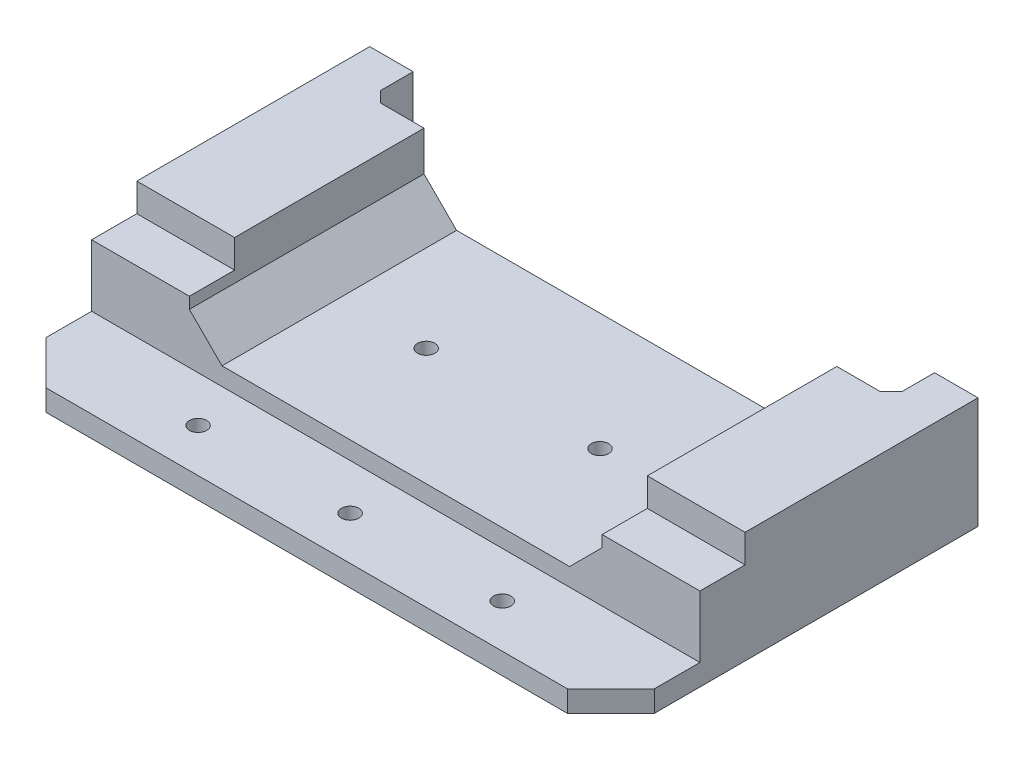
ISO-10303-21;
HEADER;
FILE_DESCRIPTION(('STEP AP214'),'2;1');
FILE_NAME('part.step','',(''),(''),'','','');
FILE_SCHEMA(('AUTOMOTIVE_DESIGN { 1 0 10303 214 1 1 1 1 }'));
ENDSEC;
DATA;
#1=APPLICATION_CONTEXT('core data for automotive mechanical design processes');
#2=APPLICATION_PROTOCOL_DEFINITION('international standard','automotive_design',2000,#1);
#3=PRODUCT_CONTEXT('',#1,'mechanical');
#4=PRODUCT('Part','Part','',(#3));
#5=PRODUCT_RELATED_PRODUCT_CATEGORY('part','',(#4));
#6=PRODUCT_DEFINITION_FORMATION('','',#4);
#7=PRODUCT_DEFINITION_CONTEXT('part definition',#1,'design');
#8=PRODUCT_DEFINITION('design','',#6,#7);
#9=PRODUCT_DEFINITION_SHAPE('','',#8);
#10=(LENGTH_UNIT() NAMED_UNIT(*) SI_UNIT(.MILLI.,.METRE.));
#11=(NAMED_UNIT(*) PLANE_ANGLE_UNIT() SI_UNIT($,.RADIAN.));
#12=(NAMED_UNIT(*) SI_UNIT($,.STERADIAN.) SOLID_ANGLE_UNIT());
#13=UNCERTAINTY_MEASURE_WITH_UNIT(LENGTH_MEASURE(1.E-05),#10,'distance_accuracy_value','');
#14=(GEOMETRIC_REPRESENTATION_CONTEXT(3) GLOBAL_UNCERTAINTY_ASSIGNED_CONTEXT((#13)) GLOBAL_UNIT_ASSIGNED_CONTEXT((#10,
#11,#12)) REPRESENTATION_CONTEXT('',''));
#15=CARTESIAN_POINT('',(0.,0.,0.));
#16=DIRECTION('',(0.,0.,1.));
#17=DIRECTION('',(1.,0.,0.));
#18=AXIS2_PLACEMENT_3D('',#15,#16,#17);
#19=CARTESIAN_POINT('',(-88.9000000000008,42.0379759290028,196.598397899981));
#20=DIRECTION('',(0.,1.00000000000001,0.));
#21=DIRECTION('',(-1.00000000000001,0.,0.));
#22=AXIS2_PLACEMENT_3D('',#19,#20,#21);
#23=PLANE('',#22);
#24=CARTESIAN_POINT('',(25.4000000000006,42.0379759290017,-19.049999975798));
#25=DIRECTION('',(0.,-1.00000000000001,0.));
#26=DIRECTION('',(0.,0.,-1.00000000000001));
#27=AXIS2_PLACEMENT_3D('',#24,#25,#26);
#28=CIRCLE('',#27,2.99720000000001);
#29=CARTESIAN_POINT('',(25.4000000000006,42.0379759290017,-22.0471999757981));
#30=VERTEX_POINT('',#29);
#31=EDGE_CURVE('E555',#30,#30,#28,.T.);
#32=ORIENTED_EDGE('',*,*,#31,.F.);
#33=EDGE_LOOP('',(#32));
#34=FACE_BOUND('',#33,.T.);
#35=CARTESIAN_POINT('',(-25.4000000000004,42.0379759290017,-19.049999975798));
#36=DIRECTION('',(0.,-1.00000000000001,0.));
#37=DIRECTION('',(0.,0.,-1.00000000000001));
#38=AXIS2_PLACEMENT_3D('',#35,#36,#37);
#39=CIRCLE('',#38,2.99720000000001);
#40=CARTESIAN_POINT('',(-25.4000000000004,42.0379759290017,-22.0471999757981));
#41=VERTEX_POINT('',#40);
#42=EDGE_CURVE('E387',#41,#41,#39,.T.);
#43=ORIENTED_EDGE('',*,*,#42,.F.);
#44=EDGE_LOOP('',(#43));
#45=FACE_BOUND('',#44,.T.);
#46=CARTESIAN_POINT('',(0.,42.0379759289999,28.5750000483862));
#47=DIRECTION('',(0.,-1.00000000000001,0.));
#48=DIRECTION('',(0.,0.,-1.00000000000001));
#49=AXIS2_PLACEMENT_3D('',#46,#47,#48);
#50=CIRCLE('',#49,2.52729999999999);
#51=CARTESIAN_POINT('',(0.,42.037975929,26.0477000483862));
#52=VERTEX_POINT('',#51);
#53=EDGE_CURVE('E245',#52,#52,#50,.T.);
#54=ORIENTED_EDGE('',*,*,#53,.F.);
#55=EDGE_LOOP('',(#54));
#56=FACE_BOUND('',#55,.T.);
#57=CARTESIAN_POINT('',(-44.4500000000006,42.0379759289999,28.5750000483862));
#58=DIRECTION('',(0.,-1.00000000000001,0.));
#59=DIRECTION('',(0.,0.,-1.00000000000001));
#60=AXIS2_PLACEMENT_3D('',#57,#58,#59);
#61=CIRCLE('',#60,2.52729999999999);
#62=CARTESIAN_POINT('',(-44.4500000000006,42.037975929,26.0477000483862));
#63=VERTEX_POINT('',#62);
#64=EDGE_CURVE('E251',#63,#63,#61,.T.);
#65=ORIENTED_EDGE('',*,*,#64,.F.);
#66=EDGE_LOOP('',(#65));
#67=FACE_BOUND('',#66,.T.);
#68=CARTESIAN_POINT('',(44.4499999999999,42.0379759289999,28.5750000483862));
#69=DIRECTION('',(0.,-1.00000000000001,0.));
#70=DIRECTION('',(0.,0.,-1.00000000000001));
#71=AXIS2_PLACEMENT_3D('',#68,#69,#70);
#72=CIRCLE('',#71,2.52729999999999);
#73=CARTESIAN_POINT('',(44.4499999999999,42.037975929,26.0477000483862));
#74=VERTEX_POINT('',#73);
#75=EDGE_CURVE('E259',#74,#74,#72,.T.);
#76=ORIENTED_EDGE('',*,*,#75,.F.);
#77=EDGE_LOOP('',(#76));
#78=FACE_BOUND('',#77,.T.);
#79=DIRECTION('',(-1.00000000000001,0.,0.));
#80=VECTOR('',#79,1.);
#81=CARTESIAN_POINT('',(76.2000000000005,42.0379759290022,-53.3399999999915));
#82=LINE('',#81,#80);
#83=CARTESIAN_POINT('',(73.0250000000005,42.0379759290022,-53.3399999999915));
#84=VERTEX_POINT('',#83);
#85=CARTESIAN_POINT('',(-73.0250000000005,42.0379759290022,-53.3399999999915));
#86=VERTEX_POINT('',#85);
#87=EDGE_CURVE('E492',#84,#86,#82,.T.);
#88=ORIENTED_EDGE('',*,*,#87,.F.);
#89=DIRECTION('',(-0.707106781186558,0.,0.707106781186545));
#90=VECTOR('',#89,1.);
#91=CARTESIAN_POINT('',(-132.906698949992,42.0379759290042,152.591698949985));
#92=LINE('',#91,#90);
#93=CARTESIAN_POINT('',(76.2000000000013,42.0379759290039,-56.5150000000028));
#94=VERTEX_POINT('',#93);
#95=EDGE_CURVE('E367',#84,#94,#92,.F.);
#96=ORIENTED_EDGE('',*,*,#95,.T.);
#97=DIRECTION('',(0.,0.,1.00000000000001));
#98=VECTOR('',#97,1.);
#99=CARTESIAN_POINT('',(76.2000000000011,42.0379759290046,-66.0400000000028));
#100=LINE('',#99,#98);
#101=CARTESIAN_POINT('',(76.2000000000011,42.0379759290046,-66.0400000000028));
#102=VERTEX_POINT('',#101);
#103=EDGE_CURVE('E488',#102,#94,#100,.T.);
#104=ORIENTED_EDGE('',*,*,#103,.F.);
#105=DIRECTION('',(1.00000000000001,0.,0.));
#106=VECTOR('',#105,1.);
#107=CARTESIAN_POINT('',(88.9000000000006,42.0379759290046,-66.0400000000028));
#108=LINE('',#107,#106);
#109=CARTESIAN_POINT('',(88.9000000000006,42.0379759290046,-66.0400000000028));
#110=VERTEX_POINT('',#109);
#111=EDGE_CURVE('E280',#102,#110,#108,.T.);
#112=ORIENTED_EDGE('',*,*,#111,.T.);
#113=DIRECTION('',(0.,0.,-1.00000000000001));
#114=VECTOR('',#113,1.);
#115=CARTESIAN_POINT('',(88.9000000000003,42.0379759290028,196.598397899981));
#116=LINE('',#115,#114);
#117=CARTESIAN_POINT('',(88.9000000000003,42.0379759289999,28.5750000483862));
#118=VERTEX_POINT('',#117);
#119=EDGE_CURVE('E302',#118,#110,#116,.T.);
#120=ORIENTED_EDGE('',*,*,#119,.F.);
#121=DIRECTION('',(-0.707106781186554,0.,0.70710678118655));
#122=VECTOR('',#121,1.);
#123=CARTESIAN_POINT('',(88.9000000000003,42.0379759289999,28.5750000483862));
#124=LINE('',#123,#122);
#125=CARTESIAN_POINT('',(76.1999999999996,42.0379759289962,41.2750000483832));
#126=VERTEX_POINT('',#125);
#127=EDGE_CURVE('E319',#118,#126,#124,.T.);
#128=ORIENTED_EDGE('',*,*,#127,.T.);
#129=DIRECTION('',(-1.00000000000001,0.,0.));
#130=VECTOR('',#129,1.);
#131=CARTESIAN_POINT('',(88.8999999999996,42.0379759289962,41.2750000483832));
#132=LINE('',#131,#130);
#133=CARTESIAN_POINT('',(-76.2000000000012,42.0379759289962,41.2750000483832));
#134=VERTEX_POINT('',#133);
#135=EDGE_CURVE('E267',#126,#134,#132,.T.);
#136=ORIENTED_EDGE('',*,*,#135,.T.);
#137=DIRECTION('',(-0.707106781186551,0.,-0.707106781186553));
#138=VECTOR('',#137,1.);
#139=CARTESIAN_POINT('',(-76.2000000000012,42.0379759289962,41.2750000483832));
#140=LINE('',#139,#138);
#141=CARTESIAN_POINT('',(-88.9000000000007,42.0379759289995,28.575000048388));
#142=VERTEX_POINT('',#141);
#143=EDGE_CURVE('E322',#134,#142,#140,.T.);
#144=ORIENTED_EDGE('',*,*,#143,.T.);
#145=DIRECTION('',(0.,0.,-1.00000000000001));
#146=VECTOR('',#145,1.);
#147=CARTESIAN_POINT('',(-88.9000000000008,42.0379759290028,196.598397899981));
#148=LINE('',#147,#146);
#149=CARTESIAN_POINT('',(-88.9000000000006,42.0379759290046,-66.0400000000028));
#150=VERTEX_POINT('',#149);
#151=EDGE_CURVE('E293',#142,#150,#148,.T.);
#152=ORIENTED_EDGE('',*,*,#151,.T.);
#153=CARTESIAN_POINT('',(-76.1999999999997,42.0379759290046,-66.0400000000028));
#154=VERTEX_POINT('',#153);
#155=EDGE_CURVE('E281',#150,#154,#108,.T.);
#156=ORIENTED_EDGE('',*,*,#155,.T.);
#157=DIRECTION('',(0.,0.,-1.00000000000001));
#158=VECTOR('',#157,1.);
#159=CARTESIAN_POINT('',(-76.1999999999997,42.0379759290046,-66.0400000000028));
#160=LINE('',#159,#158);
#161=CARTESIAN_POINT('',(-76.1999999999997,42.0379759290042,-56.5150000000036));
#162=VERTEX_POINT('',#161);
#163=EDGE_CURVE('E496',#162,#154,#160,.T.);
#164=ORIENTED_EDGE('',*,*,#163,.F.);
#165=DIRECTION('',(-0.707106781186549,0.,-0.707106781186557));
#166=VECTOR('',#165,1.);
#167=CARTESIAN_POINT('',(44.0066989499889,42.0379759290037,63.6916989499872));
#168=LINE('',#167,#166);
#169=EDGE_CURVE('E52',#162,#86,#168,.F.);
#170=ORIENTED_EDGE('',*,*,#169,.T.);
#171=EDGE_LOOP('',(#88,#96,#104,#112,#120,#128,#136,#144,#152,#156,#164,#170));
#172=FACE_BOUND('',#171,.T.);
#173=ADVANCED_FACE('F42',(#34,#45,#56,#67,#78,#172),#23,.F.);
#174=CARTESIAN_POINT('',(-88.9000000000006,74.6124999999982,41.2750000483655));
#175=DIRECTION('',(0.,-1.00000000000001,0.));
#176=DIRECTION('',(1.,0.,0.));
#177=AXIS2_PLACEMENT_3D('',#174,#175,#176);
#178=PLANE('',#177);
#179=DIRECTION('',(1.,0.,0.));
#180=VECTOR('',#179,1.);
#181=CARTESIAN_POINT('',(76.2000000000002,74.6124999999995,-53.3399999999986));
#182=LINE('',#181,#180);
#183=CARTESIAN_POINT('',(60.3250000000002,74.6124999999995,-53.3399999999986));
#184=VERTEX_POINT('',#183);
#185=CARTESIAN_POINT('',(73.0250000000003,74.6124999999995,-53.3399999999986));
#186=VERTEX_POINT('',#185);
#187=EDGE_CURVE('E479',#184,#186,#182,.T.);
#188=ORIENTED_EDGE('',*,*,#187,.F.);
#189=DIRECTION('',(0.,0.,-1.00000000000001));
#190=VECTOR('',#189,1.);
#191=CARTESIAN_POINT('',(60.3250000000003,74.6124999999982,41.2750000483655));
#192=LINE('',#191,#190);
#193=CARTESIAN_POINT('',(60.3250000000002,74.6124999999944,2.03200004838777));
#194=VERTEX_POINT('',#193);
#195=EDGE_CURVE('E416',#194,#184,#192,.T.);
#196=ORIENTED_EDGE('',*,*,#195,.F.);
#197=DIRECTION('',(1.00000000000001,0.,0.));
#198=VECTOR('',#197,1.);
#199=CARTESIAN_POINT('',(-88.9000000000014,74.6124999999944,2.03200004838777));
#200=LINE('',#199,#198);
#201=CARTESIAN_POINT('',(88.9000000000005,74.6124999999944,2.03200004838777));
#202=VERTEX_POINT('',#201);
#203=EDGE_CURVE('E450',#194,#202,#200,.T.);
#204=ORIENTED_EDGE('',*,*,#203,.T.);
#205=DIRECTION('',(0.,0.,-1.00000000000001));
#206=VECTOR('',#205,1.);
#207=CARTESIAN_POINT('',(88.9000000000005,74.6124999999982,41.2750000483655));
#208=LINE('',#207,#206);
#209=CARTESIAN_POINT('',(88.9000000000006,74.6124999999991,-66.0400000000028));
#210=VERTEX_POINT('',#209);
#211=EDGE_CURVE('E475',#202,#210,#208,.T.);
#212=ORIENTED_EDGE('',*,*,#211,.T.);
#213=DIRECTION('',(-1.,0.,0.));
#214=VECTOR('',#213,1.);
#215=CARTESIAN_POINT('',(-88.9000000000006,74.6124999999991,-66.0400000000028));
#216=LINE('',#215,#214);
#217=CARTESIAN_POINT('',(76.2000000000004,74.6124999999991,-66.0400000000028));
#218=VERTEX_POINT('',#217);
#219=EDGE_CURVE('E471',#210,#218,#216,.T.);
#220=ORIENTED_EDGE('',*,*,#219,.T.);
#221=DIRECTION('',(0.,0.,-1.00000000000001));
#222=VECTOR('',#221,1.);
#223=CARTESIAN_POINT('',(76.2000000000004,74.6124999999991,-66.0400000000028));
#224=LINE('',#223,#222);
#225=CARTESIAN_POINT('',(76.2000000000011,74.6124999999927,-56.5149999999832));
#226=VERTEX_POINT('',#225);
#227=EDGE_CURVE('E485',#226,#218,#224,.T.);
#228=ORIENTED_EDGE('',*,*,#227,.F.);
#229=DIRECTION('',(0.707106781186558,0.,-0.707106781186545));
#230=VECTOR('',#229,1.);
#231=CARTESIAN_POINT('',(-55.2450000241859,74.6124999999973,74.9300000241879));
#232=LINE('',#231,#230);
#233=EDGE_CURVE('E370',#226,#186,#232,.F.);
#234=ORIENTED_EDGE('',*,*,#233,.T.);
#235=EDGE_LOOP('',(#188,#196,#204,#212,#220,#228,#234));
#236=FACE_BOUND('',#235,.T.);
#237=ADVANCED_FACE('F565',(#236),#178,.F.);
#238=CARTESIAN_POINT('',(-88.9000000000014,74.6124999999944,2.03200004838777));
#239=DIRECTION('',(0.,0.,-1.00000000000001));
#240=DIRECTION('',(0.,1.00000000000001,0.));
#241=AXIS2_PLACEMENT_3D('',#238,#239,#240);
#242=PLANE('',#241);
#243=ORIENTED_EDGE('',*,*,#203,.F.);
#244=DIRECTION('',(0.,-1.00000000000001,0.));
#245=VECTOR('',#244,1.);
#246=CARTESIAN_POINT('',(60.3250000000003,74.6124999999944,2.03200004838777));
#247=LINE('',#246,#245);
#248=CARTESIAN_POINT('',(60.3250000000002,66.3574999999994,2.03200004838511));
#249=VERTEX_POINT('',#248);
#250=EDGE_CURVE('E350',#194,#249,#247,.T.);
#251=ORIENTED_EDGE('',*,*,#250,.T.);
#252=DIRECTION('',(1.00000000000001,0.,0.));
#253=VECTOR('',#252,1.);
#254=CARTESIAN_POINT('',(-88.9000000000014,66.3574999999994,2.03200004838511));
#255=LINE('',#254,#253);
#256=CARTESIAN_POINT('',(88.9000000000004,66.3574999999994,2.03200004838511));
#257=VERTEX_POINT('',#256);
#258=EDGE_CURVE('E462',#249,#257,#255,.T.);
#259=ORIENTED_EDGE('',*,*,#258,.T.);
#260=DIRECTION('',(0.,1.00000000000001,0.));
#261=VECTOR('',#260,1.);
#262=CARTESIAN_POINT('',(88.9000000000005,74.6124999999944,2.03200004838777));
#263=LINE('',#262,#261);
#264=EDGE_CURVE('E440',#257,#202,#263,.T.);
#265=ORIENTED_EDGE('',*,*,#264,.T.);
#266=EDGE_LOOP('',(#243,#251,#259,#265));
#267=FACE_BOUND('',#266,.T.);
#268=ADVANCED_FACE('F568',(#267),#242,.F.);
#269=CARTESIAN_POINT('',(88.8999999999996,255.936068037166,-66.0400000000028));
#270=DIRECTION('',(0.,0.,-1.00000000000001));
#271=DIRECTION('',(-1.00000000000001,0.,0.));
#272=AXIS2_PLACEMENT_3D('',#269,#270,#271);
#273=PLANE('',#272);
#274=ORIENTED_EDGE('',*,*,#219,.F.);
#275=DIRECTION('',(0.,-1.00000000000001,0.));
#276=VECTOR('',#275,1.);
#277=CARTESIAN_POINT('',(88.8999999999996,255.936068037166,-66.0400000000028));
#278=LINE('',#277,#276);
#279=EDGE_CURVE('E273',#210,#110,#278,.T.);
#280=ORIENTED_EDGE('',*,*,#279,.T.);
#281=ORIENTED_EDGE('',*,*,#111,.F.);
#282=DIRECTION('',(0.,-1.00000000000001,0.));
#283=VECTOR('',#282,1.);
#284=CARTESIAN_POINT('',(76.2000000000003,77.7874999999977,-66.0399999999966));
#285=LINE('',#284,#283);
#286=EDGE_CURVE('E235',#218,#102,#285,.T.);
#287=ORIENTED_EDGE('',*,*,#286,.F.);
#288=EDGE_LOOP('',(#274,#280,#281,#287));
#289=FACE_BOUND('',#288,.T.);
#290=ADVANCED_FACE('F574',(#289),#273,.T.);
#291=CARTESIAN_POINT('',(-220.50374999998,62.5474999999884,15.2400000483652));
#292=DIRECTION('',(0.,0.,1.00000000000001));
#293=DIRECTION('',(0.,-1.00000000000001,0.));
#294=AXIS2_PLACEMENT_3D('',#291,#292,#293);
#295=PLANE('',#294);
#296=DIRECTION('',(0.,1.00000000000001,0.));
#297=VECTOR('',#296,1.);
#298=CARTESIAN_POINT('',(60.3250000000003,62.5474999999884,15.2400000483652));
#299=LINE('',#298,#297);
#300=CARTESIAN_POINT('',(60.3250000000003,63.0237499999944,15.2400000483652));
#301=VERTEX_POINT('',#300);
#302=CARTESIAN_POINT('',(60.3250000000003,66.3574999999927,15.2400000483821));
#303=VERTEX_POINT('',#302);
#304=EDGE_CURVE('E438',#301,#303,#299,.T.);
#305=ORIENTED_EDGE('',*,*,#304,.F.);
#306=DIRECTION('',(-0.707106781186551,-0.707106781186549,0.));
#307=VECTOR('',#306,1.);
#308=CARTESIAN_POINT('',(60.3250000000003,63.0237499999944,15.2400000483652));
#309=LINE('',#308,#307);
#310=CARTESIAN_POINT('',(50.7999999999999,53.4987499999944,15.2400000483652));
#311=VERTEX_POINT('',#310);
#312=EDGE_CURVE('E233',#301,#311,#309,.T.);
#313=ORIENTED_EDGE('',*,*,#312,.T.);
#314=DIRECTION('',(1.00000000000001,0.,0.));
#315=VECTOR('',#314,1.);
#316=CARTESIAN_POINT('',(-50.8000000000008,53.4987499999944,15.2400000483652));
#317=LINE('',#316,#315);
#318=CARTESIAN_POINT('',(-50.8000000000008,53.4987499999944,15.2400000483652));
#319=VERTEX_POINT('',#318);
#320=EDGE_CURVE('E223',#319,#311,#317,.T.);
#321=ORIENTED_EDGE('',*,*,#320,.F.);
#322=DIRECTION('',(-0.707106781186553,0.707106781186553,0.));
#323=VECTOR('',#322,1.);
#324=CARTESIAN_POINT('',(-60.3250000000005,63.0237499999944,15.2400000483652));
#325=LINE('',#324,#323);
#326=CARTESIAN_POINT('',(-60.3250000000005,63.0237499999944,15.2400000483652));
#327=VERTEX_POINT('',#326);
#328=EDGE_CURVE('E205',#319,#327,#325,.T.);
#329=ORIENTED_EDGE('',*,*,#328,.T.);
#330=DIRECTION('',(0.,-1.00000000000001,0.));
#331=VECTOR('',#330,1.);
#332=CARTESIAN_POINT('',(-60.3250000000004,62.5474999999884,15.2400000483652));
#333=LINE('',#332,#331);
#334=CARTESIAN_POINT('',(-60.3250000000005,66.3574999999927,15.2400000483821));
#335=VERTEX_POINT('',#334);
#336=EDGE_CURVE('E431',#335,#327,#333,.T.);
#337=ORIENTED_EDGE('',*,*,#336,.F.);
#338=DIRECTION('',(1.00000000000001,0.,0.));
#339=VECTOR('',#338,1.);
#340=CARTESIAN_POINT('',(-88.9000000000013,66.3574999999927,15.2400000483821));
#341=LINE('',#340,#339);
#342=CARTESIAN_POINT('',(-88.9000000000013,66.3574999999927,15.2400000483821));
#343=VERTEX_POINT('',#342);
#344=EDGE_CURVE('E463',#343,#335,#341,.T.);
#345=ORIENTED_EDGE('',*,*,#344,.F.);
#346=DIRECTION('',(0.,-1.00000000000001,0.));
#347=VECTOR('',#346,1.);
#348=CARTESIAN_POINT('',(-88.9000000000005,77.7874999999977,15.2400000483714));
#349=LINE('',#348,#347);
#350=CARTESIAN_POINT('',(-88.9000000000015,48.2599999999902,15.2400000483652));
#351=VERTEX_POINT('',#350);
#352=EDGE_CURVE('E299',#343,#351,#349,.T.);
#353=ORIENTED_EDGE('',*,*,#352,.T.);
#354=DIRECTION('',(1.00000000000001,0.,0.));
#355=VECTOR('',#354,1.);
#356=CARTESIAN_POINT('',(-220.50374999998,48.2599999999902,15.2400000483652));
#357=LINE('',#356,#355);
#358=CARTESIAN_POINT('',(88.9000000000004,48.25999999999,15.2400000483661));
#359=VERTEX_POINT('',#358);
#360=EDGE_CURVE('E298',#351,#359,#357,.T.);
#361=ORIENTED_EDGE('',*,*,#360,.T.);
#362=DIRECTION('',(0.,1.00000000000001,0.));
#363=VECTOR('',#362,1.);
#364=CARTESIAN_POINT('',(88.9000000000004,42.0379759290042,15.2400000483661));
#365=LINE('',#364,#363);
#366=CARTESIAN_POINT('',(88.9000000000006,66.3574999999927,15.2400000483821));
#367=VERTEX_POINT('',#366);
#368=EDGE_CURVE('E294',#359,#367,#365,.T.);
#369=ORIENTED_EDGE('',*,*,#368,.T.);
#370=EDGE_CURVE('E466',#303,#367,#341,.T.);
#371=ORIENTED_EDGE('',*,*,#370,.F.);
#372=EDGE_LOOP('',(#305,#313,#321,#329,#337,#345,#353,#361,#369,#371));
#373=FACE_BOUND('',#372,.T.);
#374=ADVANCED_FACE('F231',(#373),#295,.T.);
#375=CARTESIAN_POINT('',(-88.9000000000003,77.7874999999979,196.598397899987));
#376=DIRECTION('',(1.00000000000001,0.,0.));
#377=DIRECTION('',(0.,0.,-1.00000000000001));
#378=AXIS2_PLACEMENT_3D('',#375,#376,#377);
#379=PLANE('',#378);
#380=DIRECTION('',(0.,0.,-1.00000000000001));
#381=VECTOR('',#380,1.);
#382=CARTESIAN_POINT('',(-88.9000000000014,66.3574999999994,2.03200004838511));
#383=LINE('',#382,#381);
#384=CARTESIAN_POINT('',(-88.9000000000014,66.3574999999994,2.03200004838511));
#385=VERTEX_POINT('',#384);
#386=EDGE_CURVE('E445',#343,#385,#383,.T.);
#387=ORIENTED_EDGE('',*,*,#386,.T.);
#388=DIRECTION('',(0.,1.00000000000001,0.));
#389=VECTOR('',#388,1.);
#390=CARTESIAN_POINT('',(-88.9000000000014,74.6124999999944,2.03200004838777));
#391=LINE('',#390,#389);
#392=CARTESIAN_POINT('',(-88.9000000000014,74.6124999999944,2.03200004838777));
#393=VERTEX_POINT('',#392);
#394=EDGE_CURVE('E441',#385,#393,#391,.T.);
#395=ORIENTED_EDGE('',*,*,#394,.T.);
#396=DIRECTION('',(0.,0.,-1.00000000000001));
#397=VECTOR('',#396,1.);
#398=CARTESIAN_POINT('',(-88.9000000000006,74.6124999999982,41.2750000483655));
#399=LINE('',#398,#397);
#400=CARTESIAN_POINT('',(-88.9000000000006,74.6124999999991,-66.0400000000028));
#401=VERTEX_POINT('',#400);
#402=EDGE_CURVE('E476',#393,#401,#399,.T.);
#403=ORIENTED_EDGE('',*,*,#402,.T.);
#404=DIRECTION('',(0.,-1.00000000000001,0.));
#405=VECTOR('',#404,1.);
#406=CARTESIAN_POINT('',(-88.9000000000018,255.936068037167,-66.0400000000028));
#407=LINE('',#406,#405);
#408=EDGE_CURVE('E285',#401,#150,#407,.T.);
#409=ORIENTED_EDGE('',*,*,#408,.T.);
#410=ORIENTED_EDGE('',*,*,#151,.F.);
#411=DIRECTION('',(0.,1.00000000000001,0.));
#412=VECTOR('',#411,1.);
#413=CARTESIAN_POINT('',(-88.9000000000007,48.2599999999822,28.5750000483844));
#414=LINE('',#413,#412);
#415=CARTESIAN_POINT('',(-88.9000000000014,48.2599999999822,28.5750000483844));
#416=VERTEX_POINT('',#415);
#417=EDGE_CURVE('E325',#142,#416,#414,.T.);
#418=ORIENTED_EDGE('',*,*,#417,.T.);
#419=DIRECTION('',(0.,0.,1.00000000000001));
#420=VECTOR('',#419,1.);
#421=CARTESIAN_POINT('',(-88.9000000000006,48.2599999999893,-66.0399999999966));
#422=LINE('',#421,#420);
#423=EDGE_CURVE('E268',#351,#416,#422,.T.);
#424=ORIENTED_EDGE('',*,*,#423,.F.);
#425=ORIENTED_EDGE('',*,*,#352,.F.);
#426=EDGE_LOOP('',(#387,#395,#403,#409,#410,#418,#424,#425));
#427=FACE_BOUND('',#426,.T.);
#428=ADVANCED_FACE('F514',(#427),#379,.F.);
#429=CARTESIAN_POINT('',(88.9000000000003,42.0379759290028,196.598397899981));
#430=DIRECTION('',(-1.00000000000001,0.,0.));
#431=DIRECTION('',(0.,0.,1.00000000000001));
#432=AXIS2_PLACEMENT_3D('',#429,#430,#431);
#433=PLANE('',#432);
#434=ORIENTED_EDGE('',*,*,#211,.F.);
#435=ORIENTED_EDGE('',*,*,#264,.F.);
#436=DIRECTION('',(0.,0.,-1.00000000000001));
#437=VECTOR('',#436,1.);
#438=CARTESIAN_POINT('',(88.9000000000004,66.3574999999994,2.03200004838511));
#439=LINE('',#438,#437);
#440=EDGE_CURVE('E446',#367,#257,#439,.T.);
#441=ORIENTED_EDGE('',*,*,#440,.F.);
#442=ORIENTED_EDGE('',*,*,#368,.F.);
#443=DIRECTION('',(0.,0.,-1.00000000000001));
#444=VECTOR('',#443,1.);
#445=CARTESIAN_POINT('',(88.9000000000004,48.2599999999891,-66.0399999999957));
#446=LINE('',#445,#444);
#447=CARTESIAN_POINT('',(88.8999999999997,48.259999999982,28.5750000483853));
#448=VERTEX_POINT('',#447);
#449=EDGE_CURVE('E272',#448,#359,#446,.T.);
#450=ORIENTED_EDGE('',*,*,#449,.F.);
#451=DIRECTION('',(0.,-1.00000000000001,0.));
#452=VECTOR('',#451,1.);
#453=CARTESIAN_POINT('',(88.9000000000003,42.0379759289999,28.5750000483862));
#454=LINE('',#453,#452);
#455=EDGE_CURVE('E334',#448,#118,#454,.T.);
#456=ORIENTED_EDGE('',*,*,#455,.T.);
#457=ORIENTED_EDGE('',*,*,#119,.T.);
#458=ORIENTED_EDGE('',*,*,#279,.F.);
#459=EDGE_LOOP('',(#434,#435,#441,#442,#450,#456,#457,#458));
#460=FACE_BOUND('',#459,.T.);
#461=ADVANCED_FACE('F536',(#460),#433,.F.);
#462=CARTESIAN_POINT('',(88.8999999999995,255.936068037162,41.2750000483655));
#463=DIRECTION('',(0.,0.,1.00000000000001));
#464=DIRECTION('',(1.,0.,0.));
#465=AXIS2_PLACEMENT_3D('',#462,#463,#464);
#466=PLANE('',#465);
#467=DIRECTION('',(1.00000000000001,0.,0.));
#468=VECTOR('',#467,1.);
#469=CARTESIAN_POINT('',(88.8999999999997,48.2599999999891,41.2750000483655));
#470=LINE('',#469,#468);
#471=CARTESIAN_POINT('',(-76.2000000000012,48.2599999999891,41.2750000483655));
#472=VERTEX_POINT('',#471);
#473=CARTESIAN_POINT('',(76.1999999999996,48.2599999999891,41.2750000483655));
#474=VERTEX_POINT('',#473);
#475=EDGE_CURVE('E276',#472,#474,#470,.T.);
#476=ORIENTED_EDGE('',*,*,#475,.F.);
#477=DIRECTION('',(0.,-1.00000000000001,0.));
#478=VECTOR('',#477,1.);
#479=CARTESIAN_POINT('',(-76.2000000000012,42.0379759289962,41.2750000483832));
#480=LINE('',#479,#478);
#481=EDGE_CURVE('E315',#472,#134,#480,.T.);
#482=ORIENTED_EDGE('',*,*,#481,.T.);
#483=ORIENTED_EDGE('',*,*,#135,.F.);
#484=DIRECTION('',(0.,1.00000000000001,0.));
#485=VECTOR('',#484,1.);
#486=CARTESIAN_POINT('',(76.1999999999996,48.2599999999891,41.2750000483655));
#487=LINE('',#486,#485);
#488=EDGE_CURVE('E312',#126,#474,#487,.T.);
#489=ORIENTED_EDGE('',*,*,#488,.T.);
#490=EDGE_LOOP('',(#476,#482,#483,#489));
#491=FACE_BOUND('',#490,.T.);
#492=ADVANCED_FACE('F526',(#491),#466,.T.);
#493=CARTESIAN_POINT('',(-182.40374999998,48.259999999982,20.6375000483874));
#494=DIRECTION('',(0.,-1.00000000000001,0.));
#495=DIRECTION('',(1.00000000000001,0.,0.));
#496=AXIS2_PLACEMENT_3D('',#493,#494,#495);
#497=PLANE('',#496);
#498=CARTESIAN_POINT('',(0.,48.259999999982,28.5750000483853));
#499=DIRECTION('',(0.,-1.00000000000001,0.));
#500=DIRECTION('',(1.,0.,0.));
#501=AXIS2_PLACEMENT_3D('',#498,#499,#500);
#502=CIRCLE('',#501,2.52729999999999);
#503=CARTESIAN_POINT('',(2.52730000000006,48.259999999982,28.5750000483853));
#504=VERTEX_POINT('',#503);
#505=EDGE_CURVE('E250',#504,#504,#502,.T.);
#506=ORIENTED_EDGE('',*,*,#505,.T.);
#507=EDGE_LOOP('',(#506));
#508=FACE_BOUND('',#507,.T.);
#509=CARTESIAN_POINT('',(-44.4500000000006,48.259999999982,28.5750000483853));
#510=DIRECTION('',(0.,-1.00000000000001,0.));
#511=DIRECTION('',(1.,0.,0.));
#512=AXIS2_PLACEMENT_3D('',#509,#510,#511);
#513=CIRCLE('',#512,2.52729999999999);
#514=CARTESIAN_POINT('',(-41.9227000000006,48.259999999982,28.5750000483853));
#515=VERTEX_POINT('',#514);
#516=EDGE_CURVE('E255',#515,#515,#513,.T.);
#517=ORIENTED_EDGE('',*,*,#516,.T.);
#518=EDGE_LOOP('',(#517));
#519=FACE_BOUND('',#518,.T.);
#520=CARTESIAN_POINT('',(44.4499999999998,48.2599999999818,28.5750000483862));
#521=DIRECTION('',(0.,-1.00000000000001,0.));
#522=DIRECTION('',(1.,0.,0.));
#523=AXIS2_PLACEMENT_3D('',#520,#521,#522);
#524=CIRCLE('',#523,2.52729999999999);
#525=CARTESIAN_POINT('',(46.9772999999998,48.2599999999818,28.5750000483862));
#526=VERTEX_POINT('',#525);
#527=EDGE_CURVE('E263',#526,#526,#524,.T.);
#528=ORIENTED_EDGE('',*,*,#527,.T.);
#529=EDGE_LOOP('',(#528));
#530=FACE_BOUND('',#529,.T.);
#531=ORIENTED_EDGE('',*,*,#423,.T.);
#532=DIRECTION('',(0.707106781186552,0.,0.707106781186553));
#533=VECTOR('',#532,1.);
#534=CARTESIAN_POINT('',(-76.2000000000012,48.2599999999891,41.2750000483655));
#535=LINE('',#534,#533);
#536=EDGE_CURVE('E331',#416,#472,#535,.T.);
#537=ORIENTED_EDGE('',*,*,#536,.T.);
#538=ORIENTED_EDGE('',*,*,#475,.T.);
#539=DIRECTION('',(0.707106781186553,0.,-0.70710678118655));
#540=VECTOR('',#539,1.);
#541=CARTESIAN_POINT('',(88.9000000000005,48.259999999982,28.5750000483853));
#542=LINE('',#541,#540);
#543=EDGE_CURVE('E328',#474,#448,#542,.T.);
#544=ORIENTED_EDGE('',*,*,#543,.T.);
#545=ORIENTED_EDGE('',*,*,#449,.T.);
#546=ORIENTED_EDGE('',*,*,#360,.F.);
#547=EDGE_LOOP('',(#531,#537,#538,#544,#545,#546));
#548=FACE_BOUND('',#547,.T.);
#549=ADVANCED_FACE('F522',(#508,#519,#530,#548),#497,.F.);
#550=CARTESIAN_POINT('',(-76.2000000000007,74.6124999999991,-66.0400000000028));
#551=VERTEX_POINT('',#550);
#552=EDGE_CURVE('E461',#551,#401,#216,.T.);
#553=ORIENTED_EDGE('',*,*,#552,.F.);
#554=DIRECTION('',(0.,-1.00000000000001,0.));
#555=VECTOR('',#554,1.);
#556=CARTESIAN_POINT('',(-76.2000000000006,77.7874999999977,-66.0399999999966));
#557=LINE('',#556,#555);
#558=EDGE_CURVE('E240',#551,#154,#557,.T.);
#559=ORIENTED_EDGE('',*,*,#558,.T.);
#560=ORIENTED_EDGE('',*,*,#155,.F.);
#561=ORIENTED_EDGE('',*,*,#408,.F.);
#562=EDGE_LOOP('',(#553,#559,#560,#561));
#563=FACE_BOUND('',#562,.T.);
#564=ADVANCED_FACE('F506',(#563),#273,.T.);
#565=CARTESIAN_POINT('',(-76.2000000000015,255.936068037162,41.2750000483655));
#566=DIRECTION('',(-0.707106781186552,0.,0.707106781186553));
#567=DIRECTION('',(0.,1.00000000000001,0.));
#568=AXIS2_PLACEMENT_3D('',#565,#566,#567);
#569=PLANE('',#568);
#570=ORIENTED_EDGE('',*,*,#536,.F.);
#571=ORIENTED_EDGE('',*,*,#417,.F.);
#572=ORIENTED_EDGE('',*,*,#143,.F.);
#573=ORIENTED_EDGE('',*,*,#481,.F.);
#574=EDGE_LOOP('',(#570,#571,#572,#573));
#575=FACE_BOUND('',#574,.T.);
#576=ADVANCED_FACE('F518',(#575),#569,.T.);
#577=CARTESIAN_POINT('',(88.9000000000003,42.0379759289999,28.5750000483862));
#578=DIRECTION('',(0.707106781186551,0.,0.707106781186554));
#579=DIRECTION('',(0.,1.00000000000001,0.));
#580=AXIS2_PLACEMENT_3D('',#577,#578,#579);
#581=PLANE('',#580);
#582=ORIENTED_EDGE('',*,*,#543,.F.);
#583=ORIENTED_EDGE('',*,*,#488,.F.);
#584=ORIENTED_EDGE('',*,*,#127,.F.);
#585=ORIENTED_EDGE('',*,*,#455,.F.);
#586=EDGE_LOOP('',(#582,#583,#584,#585));
#587=FACE_BOUND('',#586,.T.);
#588=ADVANCED_FACE('F530',(#587),#581,.T.);
#589=CARTESIAN_POINT('',(44.4499999999999,42.0379759289999,28.5750000483862));
#590=DIRECTION('',(0.,-1.00000000000001,0.));
#591=DIRECTION('',(0.,0.,-1.00000000000001));
#592=AXIS2_PLACEMENT_3D('',#589,#590,#591);
#593=CYLINDRICAL_SURFACE('',#592,2.52729999999999);
#594=ORIENTED_EDGE('',*,*,#75,.T.);
#595=EDGE_LOOP('',(#594));
#596=FACE_BOUND('',#595,.T.);
#597=ORIENTED_EDGE('',*,*,#527,.F.);
#598=EDGE_LOOP('',(#597));
#599=FACE_BOUND('',#598,.T.);
#600=ADVANCED_FACE('F620',(#596,#599),#593,.F.);
#601=CARTESIAN_POINT('',(-44.4500000000006,42.0379759289999,28.5750000483862));
#602=DIRECTION('',(0.,-1.00000000000001,0.));
#603=DIRECTION('',(0.,0.,-1.00000000000001));
#604=AXIS2_PLACEMENT_3D('',#601,#602,#603);
#605=CYLINDRICAL_SURFACE('',#604,2.52729999999999);
#606=ORIENTED_EDGE('',*,*,#64,.T.);
#607=EDGE_LOOP('',(#606));
#608=FACE_BOUND('',#607,.T.);
#609=ORIENTED_EDGE('',*,*,#516,.F.);
#610=EDGE_LOOP('',(#609));
#611=FACE_BOUND('',#610,.T.);
#612=ADVANCED_FACE('F853',(#608,#611),#605,.F.);
#613=CARTESIAN_POINT('',(0.,42.0379759289999,28.5750000483862));
#614=DIRECTION('',(0.,-1.00000000000001,0.));
#615=DIRECTION('',(0.,0.,-1.00000000000001));
#616=AXIS2_PLACEMENT_3D('',#613,#614,#615);
#617=CYLINDRICAL_SURFACE('',#616,2.52729999999999);
#618=ORIENTED_EDGE('',*,*,#53,.T.);
#619=EDGE_LOOP('',(#618));
#620=FACE_BOUND('',#619,.T.);
#621=ORIENTED_EDGE('',*,*,#505,.F.);
#622=EDGE_LOOP('',(#621));
#623=FACE_BOUND('',#622,.T.);
#624=ADVANCED_FACE('F863',(#620,#623),#617,.F.);
#625=CARTESIAN_POINT('',(-50.8000000000007,53.498749999989,-66.0399999999814));
#626=DIRECTION('',(0.,-1.00000000000001,0.));
#627=DIRECTION('',(0.,0.,-1.00000000000001));
#628=AXIS2_PLACEMENT_3D('',#625,#626,#627);
#629=PLANE('',#628);
#630=CARTESIAN_POINT('',(25.4000000000007,53.4987499999942,-19.0499999758194));
#631=DIRECTION('',(0.,-1.00000000000001,0.));
#632=DIRECTION('',(0.,0.,-1.00000000000001));
#633=AXIS2_PLACEMENT_3D('',#630,#631,#632);
#634=CIRCLE('',#633,2.52729999999999);
#635=CARTESIAN_POINT('',(25.4000000000007,53.4987499999942,-21.5772999758194));
#636=VERTEX_POINT('',#635);
#637=EDGE_CURVE('E377',#636,#636,#634,.T.);
#638=ORIENTED_EDGE('',*,*,#637,.T.);
#639=EDGE_LOOP('',(#638));
#640=FACE_BOUND('',#639,.T.);
#641=CARTESIAN_POINT('',(-25.4000000000004,53.4987499999942,-19.0499999758194));
#642=DIRECTION('',(0.,-1.00000000000001,0.));
#643=DIRECTION('',(0.,0.,-1.00000000000001));
#644=AXIS2_PLACEMENT_3D('',#641,#642,#643);
#645=CIRCLE('',#644,2.52729999999999);
#646=CARTESIAN_POINT('',(-25.4000000000004,53.4987499999942,-21.5772999758194));
#647=VERTEX_POINT('',#646);
#648=EDGE_CURVE('E218',#647,#647,#645,.T.);
#649=ORIENTED_EDGE('',*,*,#648,.T.);
#650=EDGE_LOOP('',(#649));
#651=FACE_BOUND('',#650,.T.);
#652=DIRECTION('',(0.,0.,1.00000000000001));
#653=VECTOR('',#652,1.);
#654=CARTESIAN_POINT('',(50.7999999999999,53.498749999989,-66.0399999999814));
#655=LINE('',#654,#653);
#656=CARTESIAN_POINT('',(50.7999999999998,53.498749999993,-53.3400000000004));
#657=VERTEX_POINT('',#656);
#658=EDGE_CURVE('E227',#657,#311,#655,.T.);
#659=ORIENTED_EDGE('',*,*,#658,.F.);
#660=DIRECTION('',(-1.00000000000001,0.,0.));
#661=VECTOR('',#660,1.);
#662=CARTESIAN_POINT('',(-50.8000000000008,53.4987499999935,-53.3400000000004));
#663=LINE('',#662,#661);
#664=CARTESIAN_POINT('',(-50.8000000000008,53.4987499999935,-53.3400000000004));
#665=VERTEX_POINT('',#664);
#666=EDGE_CURVE('E225',#657,#665,#663,.T.);
#667=ORIENTED_EDGE('',*,*,#666,.T.);
#668=DIRECTION('',(0.,0.,1.00000000000001));
#669=VECTOR('',#668,1.);
#670=CARTESIAN_POINT('',(-50.8000000000007,53.498749999989,-66.0399999999814));
#671=LINE('',#670,#669);
#672=EDGE_CURVE('E208',#665,#319,#671,.T.);
#673=ORIENTED_EDGE('',*,*,#672,.T.);
#674=ORIENTED_EDGE('',*,*,#320,.T.);
#675=EDGE_LOOP('',(#659,#667,#673,#674));
#676=FACE_BOUND('',#675,.T.);
#677=ADVANCED_FACE('F222',(#640,#651,#676),#629,.F.);
#678=CARTESIAN_POINT('',(76.2000000000003,77.7874999999981,-53.3399999999808));
#679=DIRECTION('',(0.,0.,1.00000000000001));
#680=DIRECTION('',(1.00000000000001,0.,0.));
#681=AXIS2_PLACEMENT_3D('',#678,#679,#680);
#682=PLANE('',#681);
#683=ORIENTED_EDGE('',*,*,#187,.T.);
#684=DIRECTION('',(0.,-1.00000000000001,0.));
#685=VECTOR('',#684,1.);
#686=CARTESIAN_POINT('',(73.0250000000005,42.0379759290022,-53.3399999999915));
#687=LINE('',#686,#685);
#688=EDGE_CURVE('E357',#186,#84,#687,.T.);
#689=ORIENTED_EDGE('',*,*,#688,.T.);
#690=ORIENTED_EDGE('',*,*,#87,.T.);
#691=DIRECTION('',(0.,1.00000000000001,0.));
#692=VECTOR('',#691,1.);
#693=CARTESIAN_POINT('',(-73.0250000000006,74.6124999999995,-53.3399999999986));
#694=LINE('',#693,#692);
#695=CARTESIAN_POINT('',(-73.0250000000006,74.6124999999995,-53.3399999999986));
#696=VERTEX_POINT('',#695);
#697=EDGE_CURVE('E354',#86,#696,#694,.T.);
#698=ORIENTED_EDGE('',*,*,#697,.T.);
#699=CARTESIAN_POINT('',(-60.3250000000005,74.6124999999995,-53.3399999999986));
#700=VERTEX_POINT('',#699);
#701=EDGE_CURVE('E482',#696,#700,#182,.T.);
#702=ORIENTED_EDGE('',*,*,#701,.T.);
#703=DIRECTION('',(0.,1.00000000000001,0.));
#704=VECTOR('',#703,1.);
#705=CARTESIAN_POINT('',(-60.3250000000009,63.0237499999915,-53.3399999999897));
#706=LINE('',#705,#704);
#707=CARTESIAN_POINT('',(-60.3250000000009,63.0237499999915,-53.3399999999897));
#708=VERTEX_POINT('',#707);
#709=EDGE_CURVE('E411',#708,#700,#706,.T.);
#710=ORIENTED_EDGE('',*,*,#709,.F.);
#711=DIRECTION('',(0.707106781186553,-0.707106781186553,0.));
#712=VECTOR('',#711,1.);
#713=CARTESIAN_POINT('',(-60.3250000000009,63.0237499999915,-53.3399999999897));
#714=LINE('',#713,#712);
#715=EDGE_CURVE('E217',#708,#665,#714,.T.);
#716=ORIENTED_EDGE('',*,*,#715,.T.);
#717=ORIENTED_EDGE('',*,*,#666,.F.);
#718=DIRECTION('',(0.707106781186551,0.707106781186551,0.));
#719=VECTOR('',#718,1.);
#720=CARTESIAN_POINT('',(60.3249999999999,63.0237499999915,-53.3399999999897));
#721=LINE('',#720,#719);
#722=CARTESIAN_POINT('',(60.3249999999999,63.0237499999915,-53.3399999999897));
#723=VERTEX_POINT('',#722);
#724=EDGE_CURVE('E404',#657,#723,#721,.T.);
#725=ORIENTED_EDGE('',*,*,#724,.T.);
#726=DIRECTION('',(0.,-1.00000000000001,0.));
#727=VECTOR('',#726,1.);
#728=CARTESIAN_POINT('',(60.3249999999999,63.0237499999915,-53.3399999999897));
#729=LINE('',#728,#727);
#730=EDGE_CURVE('E408',#184,#723,#729,.T.);
#731=ORIENTED_EDGE('',*,*,#730,.F.);
#732=EDGE_LOOP('',(#683,#689,#690,#698,#702,#710,#716,#717,#725,#731));
#733=FACE_BOUND('',#732,.T.);
#734=ADVANCED_FACE('F583',(#733),#682,.F.);
#735=CARTESIAN_POINT('',(76.2000000000003,77.7874999999977,-66.0399999999966));
#736=DIRECTION('',(1.00000000000001,0.,0.));
#737=DIRECTION('',(0.,1.00000000000001,0.));
#738=AXIS2_PLACEMENT_3D('',#735,#736,#737);
#739=PLANE('',#738);
#740=ORIENTED_EDGE('',*,*,#103,.T.);
#741=DIRECTION('',(0.,1.00000000000001,0.));
#742=VECTOR('',#741,1.);
#743=CARTESIAN_POINT('',(76.2000000000011,74.6124999999927,-56.5149999999832));
#744=LINE('',#743,#742);
#745=EDGE_CURVE('E361',#94,#226,#744,.T.);
#746=ORIENTED_EDGE('',*,*,#745,.T.);
#747=ORIENTED_EDGE('',*,*,#227,.T.);
#748=ORIENTED_EDGE('',*,*,#286,.T.);
#749=EDGE_LOOP('',(#740,#746,#747,#748));
#750=FACE_BOUND('',#749,.T.);
#751=ADVANCED_FACE('F589',(#750),#739,.F.);
#752=CARTESIAN_POINT('',(-76.2000000000006,77.7874999999977,-66.0399999999966));
#753=DIRECTION('',(-1.00000000000001,0.,0.));
#754=DIRECTION('',(0.,-1.00000000000001,0.));
#755=AXIS2_PLACEMENT_3D('',#752,#753,#754);
#756=PLANE('',#755);
#757=DIRECTION('',(0.,0.,1.00000000000001));
#758=VECTOR('',#757,1.);
#759=CARTESIAN_POINT('',(-76.2000000000007,74.6124999999991,-66.0400000000028));
#760=LINE('',#759,#758);
#761=CARTESIAN_POINT('',(-76.1999999999998,74.6124999999931,-56.514999999985));
#762=VERTEX_POINT('',#761);
#763=EDGE_CURVE('E343',#551,#762,#760,.T.);
#764=ORIENTED_EDGE('',*,*,#763,.T.);
#765=DIRECTION('',(0.,-1.00000000000001,0.));
#766=VECTOR('',#765,1.);
#767=CARTESIAN_POINT('',(-76.1999999999997,42.0379759290042,-56.5150000000036));
#768=LINE('',#767,#766);
#769=EDGE_CURVE('E364',#762,#162,#768,.T.);
#770=ORIENTED_EDGE('',*,*,#769,.T.);
#771=ORIENTED_EDGE('',*,*,#163,.T.);
#772=ORIENTED_EDGE('',*,*,#558,.F.);
#773=EDGE_LOOP('',(#764,#770,#771,#772));
#774=FACE_BOUND('',#773,.T.);
#775=ADVANCED_FACE('F592',(#774),#756,.F.);
#776=CARTESIAN_POINT('',(-60.3250000000005,74.6124999999944,2.03200004838777));
#777=VERTEX_POINT('',#776);
#778=EDGE_CURVE('E467',#393,#777,#200,.T.);
#779=ORIENTED_EDGE('',*,*,#778,.T.);
#780=DIRECTION('',(0.,0.,-1.00000000000001));
#781=VECTOR('',#780,1.);
#782=CARTESIAN_POINT('',(-60.3250000000005,74.6124999999982,41.2750000483655));
#783=LINE('',#782,#781);
#784=EDGE_CURVE('E420',#777,#700,#783,.T.);
#785=ORIENTED_EDGE('',*,*,#784,.T.);
#786=ORIENTED_EDGE('',*,*,#701,.F.);
#787=DIRECTION('',(0.70710678118655,0.,0.707106781186558));
#788=VECTOR('',#787,1.);
#789=CARTESIAN_POINT('',(-33.6549999758161,74.6124999999986,-13.9699999758172));
#790=LINE('',#789,#788);
#791=EDGE_CURVE('E11',#696,#762,#790,.F.);
#792=ORIENTED_EDGE('',*,*,#791,.T.);
#793=ORIENTED_EDGE('',*,*,#763,.F.);
#794=ORIENTED_EDGE('',*,*,#552,.T.);
#795=ORIENTED_EDGE('',*,*,#402,.F.);
#796=EDGE_LOOP('',(#779,#785,#786,#792,#793,#794,#795));
#797=FACE_BOUND('',#796,.T.);
#798=ADVANCED_FACE('F552',(#797),#178,.F.);
#799=CARTESIAN_POINT('',(-88.9000000000014,66.3574999999994,2.03200004838511));
#800=DIRECTION('',(0.,-1.00000000000001,0.));
#801=DIRECTION('',(0.,0.,-1.00000000000001));
#802=AXIS2_PLACEMENT_3D('',#799,#800,#801);
#803=PLANE('',#802);
#804=ORIENTED_EDGE('',*,*,#344,.T.);
#805=DIRECTION('',(0.,0.,-1.00000000000001));
#806=VECTOR('',#805,1.);
#807=CARTESIAN_POINT('',(-60.3250000000005,66.3574999999994,2.03200004838511));
#808=LINE('',#807,#806);
#809=CARTESIAN_POINT('',(-60.3250000000005,66.3574999999994,2.03200004838511));
#810=VERTEX_POINT('',#809);
#811=EDGE_CURVE('E419',#335,#810,#808,.T.);
#812=ORIENTED_EDGE('',*,*,#811,.T.);
#813=EDGE_CURVE('E457',#385,#810,#255,.T.);
#814=ORIENTED_EDGE('',*,*,#813,.F.);
#815=ORIENTED_EDGE('',*,*,#386,.F.);
#816=EDGE_LOOP('',(#804,#812,#814,#815));
#817=FACE_BOUND('',#816,.T.);
#818=ADVANCED_FACE('F546',(#817),#803,.F.);
#819=ORIENTED_EDGE('',*,*,#258,.F.);
#820=DIRECTION('',(0.,0.,1.00000000000001));
#821=VECTOR('',#820,1.);
#822=CARTESIAN_POINT('',(60.3250000000002,66.3574999999994,2.03200004838511));
#823=LINE('',#822,#821);
#824=EDGE_CURVE('E434',#249,#303,#823,.T.);
#825=ORIENTED_EDGE('',*,*,#824,.T.);
#826=ORIENTED_EDGE('',*,*,#370,.T.);
#827=ORIENTED_EDGE('',*,*,#440,.T.);
#828=EDGE_LOOP('',(#819,#825,#826,#827));
#829=FACE_BOUND('',#828,.T.);
#830=ADVANCED_FACE('F645',(#829),#803,.F.);
#831=ORIENTED_EDGE('',*,*,#813,.T.);
#832=DIRECTION('',(0.,1.00000000000001,0.));
#833=VECTOR('',#832,1.);
#834=CARTESIAN_POINT('',(-60.3250000000005,74.6124999999944,2.03200004838777));
#835=LINE('',#834,#833);
#836=EDGE_CURVE('E346',#810,#777,#835,.T.);
#837=ORIENTED_EDGE('',*,*,#836,.T.);
#838=ORIENTED_EDGE('',*,*,#778,.F.);
#839=ORIENTED_EDGE('',*,*,#394,.F.);
#840=EDGE_LOOP('',(#831,#837,#838,#839));
#841=FACE_BOUND('',#840,.T.);
#842=ADVANCED_FACE('F551',(#841),#242,.F.);
#843=CARTESIAN_POINT('',(-60.3250000000004,63.0237499999928,41.2750000483681));
#844=DIRECTION('',(-1.,0.,0.));
#845=DIRECTION('',(0.,0.,1.00000000000001));
#846=AXIS2_PLACEMENT_3D('',#843,#844,#845);
#847=PLANE('',#846);
#848=ORIENTED_EDGE('',*,*,#336,.T.);
#849=DIRECTION('',(0.,0.,-1.00000000000001));
#850=VECTOR('',#849,1.);
#851=CARTESIAN_POINT('',(-60.3250000000004,63.0237499999928,41.2750000483681));
#852=LINE('',#851,#850);
#853=EDGE_CURVE('E211',#327,#708,#852,.T.);
#854=ORIENTED_EDGE('',*,*,#853,.T.);
#855=ORIENTED_EDGE('',*,*,#709,.T.);
#856=ORIENTED_EDGE('',*,*,#784,.F.);
#857=ORIENTED_EDGE('',*,*,#836,.F.);
#858=ORIENTED_EDGE('',*,*,#811,.F.);
#859=EDGE_LOOP('',(#848,#854,#855,#856,#857,#858));
#860=FACE_BOUND('',#859,.T.);
#861=ADVANCED_FACE('F548',(#860),#847,.F.);
#862=CARTESIAN_POINT('',(60.3250000000003,63.0237499999928,41.2750000483681));
#863=DIRECTION('',(1.,0.,0.));
#864=DIRECTION('',(0.,0.,-1.00000000000001));
#865=AXIS2_PLACEMENT_3D('',#862,#863,#864);
#866=PLANE('',#865);
#867=ORIENTED_EDGE('',*,*,#304,.T.);
#868=ORIENTED_EDGE('',*,*,#824,.F.);
#869=ORIENTED_EDGE('',*,*,#250,.F.);
#870=ORIENTED_EDGE('',*,*,#195,.T.);
#871=ORIENTED_EDGE('',*,*,#730,.T.);
#872=DIRECTION('',(0.,0.,-1.00000000000001));
#873=VECTOR('',#872,1.);
#874=CARTESIAN_POINT('',(60.3250000000003,63.0237499999928,41.2750000483681));
#875=LINE('',#874,#873);
#876=EDGE_CURVE('E415',#301,#723,#875,.T.);
#877=ORIENTED_EDGE('',*,*,#876,.F.);
#878=EDGE_LOOP('',(#867,#868,#869,#870,#871,#877));
#879=FACE_BOUND('',#878,.T.);
#880=ADVANCED_FACE('F632',(#879),#866,.F.);
#881=CARTESIAN_POINT('',(60.3249999999999,63.0237499999928,-66.8103841815952));
#882=DIRECTION('',(-0.707106781186553,0.707106781186554,0.));
#883=DIRECTION('',(-0.707106781186551,-0.707106781186549,0.));
#884=AXIS2_PLACEMENT_3D('',#881,#882,#883);
#885=PLANE('',#884);
#886=ORIENTED_EDGE('',*,*,#724,.F.);
#887=ORIENTED_EDGE('',*,*,#658,.T.);
#888=ORIENTED_EDGE('',*,*,#312,.F.);
#889=ORIENTED_EDGE('',*,*,#876,.T.);
#890=EDGE_LOOP('',(#886,#887,#888,#889));
#891=FACE_BOUND('',#890,.T.);
#892=ADVANCED_FACE('F627',(#891),#885,.T.);
#893=CARTESIAN_POINT('',(-60.3250000000007,63.0237499999928,-66.8103841815952));
#894=DIRECTION('',(0.70710678118655,0.707106781186549,0.));
#895=DIRECTION('',(-0.707106781186554,0.707106781186553,0.));
#896=AXIS2_PLACEMENT_3D('',#893,#894,#895);
#897=PLANE('',#896);
#898=ORIENTED_EDGE('',*,*,#715,.F.);
#899=ORIENTED_EDGE('',*,*,#853,.F.);
#900=ORIENTED_EDGE('',*,*,#328,.F.);
#901=ORIENTED_EDGE('',*,*,#672,.F.);
#902=EDGE_LOOP('',(#898,#899,#900,#901));
#903=FACE_BOUND('',#902,.T.);
#904=ADVANCED_FACE('F207',(#903),#897,.T.);
#905=CARTESIAN_POINT('',(73.0250000000004,77.7874999999981,-53.3399999999808));
#906=DIRECTION('',(-0.707106781186546,0.,-0.707106781186558));
#907=DIRECTION('',(0.,1.00000000000001,0.));
#908=AXIS2_PLACEMENT_3D('',#905,#906,#907);
#909=PLANE('',#908);
#910=ORIENTED_EDGE('',*,*,#233,.F.);
#911=ORIENTED_EDGE('',*,*,#745,.F.);
#912=ORIENTED_EDGE('',*,*,#95,.F.);
#913=ORIENTED_EDGE('',*,*,#688,.F.);
#914=EDGE_LOOP('',(#910,#911,#912,#913));
#915=FACE_BOUND('',#914,.T.);
#916=ADVANCED_FACE('F586',(#915),#909,.T.);
#917=CARTESIAN_POINT('',(-76.1999999999998,77.7874999999995,-56.5150000000028));
#918=DIRECTION('',(0.707106781186555,0.,-0.707106781186549));
#919=DIRECTION('',(0.,1.00000000000001,0.));
#920=AXIS2_PLACEMENT_3D('',#917,#918,#919);
#921=PLANE('',#920);
#922=ORIENTED_EDGE('',*,*,#791,.F.);
#923=ORIENTED_EDGE('',*,*,#697,.F.);
#924=ORIENTED_EDGE('',*,*,#169,.F.);
#925=ORIENTED_EDGE('',*,*,#769,.F.);
#926=EDGE_LOOP('',(#922,#923,#924,#925));
#927=FACE_BOUND('',#926,.T.);
#928=ADVANCED_FACE('F44',(#927),#921,.T.);
#929=CARTESIAN_POINT('',(-25.4000000000004,42.0379759290017,-19.049999975798));
#930=DIRECTION('',(0.,-1.00000000000001,0.));
#931=DIRECTION('',(0.,0.,-1.00000000000001));
#932=AXIS2_PLACEMENT_3D('',#929,#930,#931);
#933=CYLINDRICAL_SURFACE('',#932,2.52729999999999);
#934=CARTESIAN_POINT('',(-25.4000000000005,46.7369759290004,-19.0499999758078));
#935=DIRECTION('',(0.,1.00000000000001,0.));
#936=DIRECTION('',(0.,0.,1.00000000000001));
#937=AXIS2_PLACEMENT_3D('',#934,#935,#936);
#938=CIRCLE('',#937,2.52729999999999);
#939=CARTESIAN_POINT('',(-25.4000000000005,46.7369759290004,-16.5226999758078));
#940=VERTEX_POINT('',#939);
#941=EDGE_CURVE('E374',#940,#940,#938,.F.);
#942=ORIENTED_EDGE('',*,*,#941,.T.);
#943=EDGE_LOOP('',(#942));
#944=FACE_BOUND('',#943,.T.);
#945=ORIENTED_EDGE('',*,*,#648,.F.);
#946=EDGE_LOOP('',(#945));
#947=FACE_BOUND('',#946,.T.);
#948=ADVANCED_FACE('F626',(#944,#947),#933,.F.);
#949=CARTESIAN_POINT('',(25.4000000000006,42.0379759290017,-19.049999975798));
#950=DIRECTION('',(0.,-1.00000000000001,0.));
#951=DIRECTION('',(0.,0.,-1.00000000000001));
#952=AXIS2_PLACEMENT_3D('',#949,#950,#951);
#953=CYLINDRICAL_SURFACE('',#952,2.52729999999999);
#954=CARTESIAN_POINT('',(25.4000000000006,46.7369759290004,-19.0499999758078));
#955=DIRECTION('',(0.,1.00000000000001,0.));
#956=DIRECTION('',(0.,0.,1.00000000000001));
#957=AXIS2_PLACEMENT_3D('',#954,#955,#956);
#958=CIRCLE('',#957,2.52729999999999);
#959=CARTESIAN_POINT('',(25.4000000000006,46.7369759290004,-16.5226999758078));
#960=VERTEX_POINT('',#959);
#961=EDGE_CURVE('E46',#960,#960,#958,.F.);
#962=ORIENTED_EDGE('',*,*,#961,.T.);
#963=EDGE_LOOP('',(#962));
#964=FACE_BOUND('',#963,.T.);
#965=ORIENTED_EDGE('',*,*,#637,.F.);
#966=EDGE_LOOP('',(#965));
#967=FACE_BOUND('',#966,.T.);
#968=ADVANCED_FACE('F697',(#964,#967),#953,.F.);
#969=CARTESIAN_POINT('',(-25.4000000000004,46.7369759290004,-19.0499999758078));
#970=DIRECTION('',(0.,1.00000000000001,0.));
#971=DIRECTION('',(0.,0.,1.00000000000001));
#972=AXIS2_PLACEMENT_3D('',#969,#970,#971);
#973=PLANE('',#972);
#974=CARTESIAN_POINT('',(-25.4000000000004,46.7369759290004,-19.0499999758078));
#975=DIRECTION('',(0.,-1.00000000000001,0.));
#976=DIRECTION('',(0.,0.,-1.00000000000001));
#977=AXIS2_PLACEMENT_3D('',#974,#975,#976);
#978=CIRCLE('',#977,2.87020000000001);
#979=CARTESIAN_POINT('',(-25.4000000000004,46.7369759290004,-21.9201999758078));
#980=VERTEX_POINT('',#979);
#981=EDGE_CURVE('E378',#980,#980,#978,.T.);
#982=ORIENTED_EDGE('',*,*,#981,.T.);
#983=EDGE_LOOP('',(#982));
#984=FACE_BOUND('',#983,.T.);
#985=ORIENTED_EDGE('',*,*,#941,.F.);
#986=EDGE_LOOP('',(#985));
#987=FACE_BOUND('',#986,.T.);
#988=ADVANCED_FACE('F703',(#984,#987),#973,.F.);
#989=CARTESIAN_POINT('',(-25.4000000000004,42.0379759290017,-19.049999975798));
#990=DIRECTION('',(0.,-1.00000000000001,0.));
#991=DIRECTION('',(0.,0.,-1.00000000000001));
#992=AXIS2_PLACEMENT_3D('',#989,#990,#991);
#993=CONICAL_SURFACE('',#992,2.99720000000001,0.0270204491872645);
#994=ORIENTED_EDGE('',*,*,#981,.F.);
#995=EDGE_LOOP('',(#994));
#996=FACE_BOUND('',#995,.T.);
#997=ORIENTED_EDGE('',*,*,#42,.T.);
#998=EDGE_LOOP('',(#997));
#999=FACE_BOUND('',#998,.T.);
#1000=ADVANCED_FACE('F711',(#996,#999),#993,.F.);
#1001=CARTESIAN_POINT('',(25.4000000000006,46.7369759290004,-19.0499999758078));
#1002=DIRECTION('',(0.,1.00000000000001,0.));
#1003=DIRECTION('',(0.,0.,1.00000000000001));
#1004=AXIS2_PLACEMENT_3D('',#1001,#1002,#1003);
#1005=PLANE('',#1004);
#1006=CARTESIAN_POINT('',(25.4000000000006,46.7369759290004,-19.0499999758078));
#1007=DIRECTION('',(0.,-1.00000000000001,0.));
#1008=DIRECTION('',(0.,0.,-1.00000000000001));
#1009=AXIS2_PLACEMENT_3D('',#1006,#1007,#1008);
#1010=CIRCLE('',#1009,2.87020000000001);
#1011=CARTESIAN_POINT('',(25.4000000000006,46.7369759290004,-21.9201999758078));
#1012=VERTEX_POINT('',#1011);
#1013=EDGE_CURVE('E557',#1012,#1012,#1010,.T.);
#1014=ORIENTED_EDGE('',*,*,#1013,.T.);
#1015=EDGE_LOOP('',(#1014));
#1016=FACE_BOUND('',#1015,.T.);
#1017=ORIENTED_EDGE('',*,*,#961,.F.);
#1018=EDGE_LOOP('',(#1017));
#1019=FACE_BOUND('',#1018,.T.);
#1020=ADVANCED_FACE('F719',(#1016,#1019),#1005,.F.);
#1021=CARTESIAN_POINT('',(25.4000000000006,42.0379759290017,-19.049999975798));
#1022=DIRECTION('',(0.,-1.00000000000001,0.));
#1023=DIRECTION('',(0.,0.,-1.00000000000001));
#1024=AXIS2_PLACEMENT_3D('',#1021,#1022,#1023);
#1025=CONICAL_SURFACE('',#1024,2.99720000000001,0.0270204491872645);
#1026=ORIENTED_EDGE('',*,*,#1013,.F.);
#1027=EDGE_LOOP('',(#1026));
#1028=FACE_BOUND('',#1027,.T.);
#1029=ORIENTED_EDGE('',*,*,#31,.T.);
#1030=EDGE_LOOP('',(#1029));
#1031=FACE_BOUND('',#1030,.T.);
#1032=ADVANCED_FACE('F728',(#1028,#1031),#1025,.F.);
#1033=CLOSED_SHELL('',(#173,#237,#268,#290,#374,#428,#461,#492,#549,#564,#576,#588,#600,#612,
#624,#677,#734,#751,#775,#798,#818,#830,#842,#861,#880,#892,#904,#916,#928,#948,#968,#988,#1000,
#1020,#1032));
#1034=MANIFOLD_SOLID_BREP('B2',#1033);
#1035=ADVANCED_BREP_SHAPE_REPRESENTATION('',(#18,#1034),#14);
#1036=SHAPE_DEFINITION_REPRESENTATION(#9,#1035);
ENDSEC;
END-ISO-10303-21;
